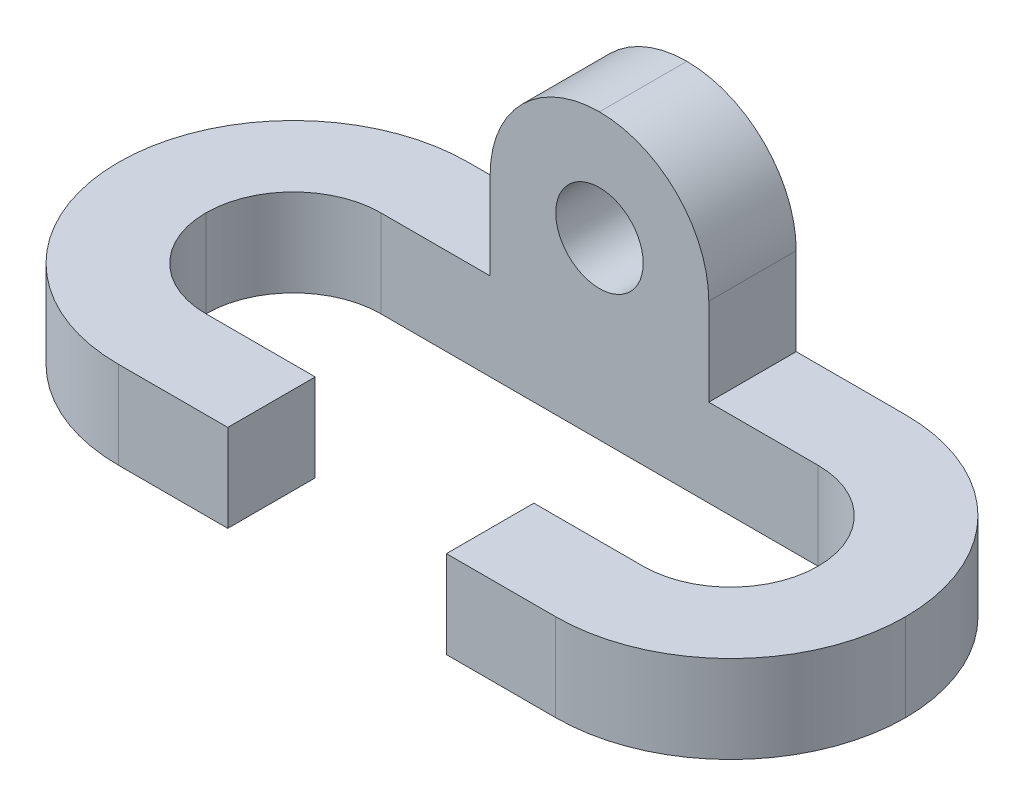
ISO-10303-21;
HEADER;
FILE_DESCRIPTION(('STEP AP214'),'2;1');
FILE_NAME('part.step','',(''),(''),'','','');
FILE_SCHEMA(('AUTOMOTIVE_DESIGN { 1 0 10303 214 1 1 1 1 }'));
ENDSEC;
DATA;
#1=APPLICATION_CONTEXT('core data for automotive mechanical design processes');
#2=APPLICATION_PROTOCOL_DEFINITION('international standard','automotive_design',2000,#1);
#3=PRODUCT_CONTEXT('',#1,'mechanical');
#4=PRODUCT('Part','Part','',(#3));
#5=PRODUCT_RELATED_PRODUCT_CATEGORY('part','',(#4));
#6=PRODUCT_DEFINITION_FORMATION('','',#4);
#7=PRODUCT_DEFINITION_CONTEXT('part definition',#1,'design');
#8=PRODUCT_DEFINITION('design','',#6,#7);
#9=PRODUCT_DEFINITION_SHAPE('','',#8);
#10=(LENGTH_UNIT() NAMED_UNIT(*) SI_UNIT(.MILLI.,.METRE.));
#11=(NAMED_UNIT(*) PLANE_ANGLE_UNIT() SI_UNIT($,.RADIAN.));
#12=(NAMED_UNIT(*) SI_UNIT($,.STERADIAN.) SOLID_ANGLE_UNIT());
#13=UNCERTAINTY_MEASURE_WITH_UNIT(LENGTH_MEASURE(1.E-05),#10,'distance_accuracy_value','');
#14=(GEOMETRIC_REPRESENTATION_CONTEXT(3) GLOBAL_UNCERTAINTY_ASSIGNED_CONTEXT((#13)) GLOBAL_UNIT_ASSIGNED_CONTEXT((#10,
#11,#12)) REPRESENTATION_CONTEXT('',''));
#15=CARTESIAN_POINT('',(0.,0.,0.));
#16=DIRECTION('',(0.,0.,1.));
#17=DIRECTION('',(1.,0.,0.));
#18=AXIS2_PLACEMENT_3D('',#15,#16,#17);
#19=CARTESIAN_POINT('',(0.,0.,0.));
#20=DIRECTION('',(0.,-1.,0.));
#21=DIRECTION('',(0.,0.,-1.));
#22=AXIS2_PLACEMENT_3D('',#19,#20,#21);
#23=PLANE('',#22);
#24=DIRECTION('',(1.,0.,0.));
#25=VECTOR('',#24,1.);
#26=CARTESIAN_POINT('',(0.,0.,0.));
#27=LINE('',#26,#25);
#28=CARTESIAN_POINT('',(25.4,0.,0.));
#29=VERTEX_POINT('',#28);
#30=CARTESIAN_POINT('',(41.275,0.,0.));
#31=VERTEX_POINT('',#30);
#32=EDGE_CURVE('E208',#29,#31,#27,.T.);
#33=ORIENTED_EDGE('',*,*,#32,.T.);
#34=DIRECTION('',(0.,0.,1.));
#35=VECTOR('',#34,1.);
#36=CARTESIAN_POINT('',(41.275,0.,-12.7));
#37=LINE('',#36,#35);
#38=CARTESIAN_POINT('',(41.275,0.,-12.7));
#39=VERTEX_POINT('',#38);
#40=EDGE_CURVE('E177',#39,#31,#37,.T.);
#41=ORIENTED_EDGE('',*,*,#40,.F.);
#42=DIRECTION('',(1.,0.,0.));
#43=VECTOR('',#42,1.);
#44=CARTESIAN_POINT('',(12.7,0.,-12.7));
#45=LINE('',#44,#43);
#46=CARTESIAN_POINT('',(25.4,0.,-12.7));
#47=VERTEX_POINT('',#46);
#48=EDGE_CURVE('E334',#47,#39,#45,.T.);
#49=ORIENTED_EDGE('',*,*,#48,.F.);
#50=CARTESIAN_POINT('',(25.4,0.,-25.4));
#51=DIRECTION('',(0.,-1.,0.));
#52=DIRECTION('',(0.,0.,-1.));
#53=AXIS2_PLACEMENT_3D('',#50,#51,#52);
#54=CIRCLE('',#53,12.7);
#55=CARTESIAN_POINT('',(12.7,0.,-25.4));
#56=VERTEX_POINT('',#55);
#57=EDGE_CURVE('E258',#47,#56,#54,.T.);
#58=ORIENTED_EDGE('',*,*,#57,.T.);
#59=CARTESIAN_POINT('',(25.4,0.,-25.4));
#60=DIRECTION('',(0.,-1.,0.));
#61=DIRECTION('',(0.,0.,-1.));
#62=AXIS2_PLACEMENT_3D('',#59,#60,#61);
#63=CIRCLE('',#62,12.7);
#64=CARTESIAN_POINT('',(25.4,0.,-38.1));
#65=VERTEX_POINT('',#64);
#66=EDGE_CURVE('E271',#56,#65,#63,.T.);
#67=ORIENTED_EDGE('',*,*,#66,.T.);
#68=DIRECTION('',(-1.,0.,0.));
#69=VECTOR('',#68,1.);
#70=CARTESIAN_POINT('',(12.7,0.,-38.1));
#71=LINE('',#70,#69);
#72=CARTESIAN_POINT('',(41.275,0.,-38.1));
#73=VERTEX_POINT('',#72);
#74=EDGE_CURVE('E336',#73,#65,#71,.T.);
#75=ORIENTED_EDGE('',*,*,#74,.F.);
#76=DIRECTION('',(0.,0.,1.));
#77=VECTOR('',#76,1.);
#78=CARTESIAN_POINT('',(41.275,0.,-50.8));
#79=LINE('',#78,#77);
#80=CARTESIAN_POINT('',(41.275,0.,-50.8));
#81=VERTEX_POINT('',#80);
#82=EDGE_CURVE('E307',#81,#73,#79,.T.);
#83=ORIENTED_EDGE('',*,*,#82,.F.);
#84=DIRECTION('',(-1.,0.,0.));
#85=VECTOR('',#84,1.);
#86=CARTESIAN_POINT('',(0.,0.,-50.8));
#87=LINE('',#86,#85);
#88=CARTESIAN_POINT('',(25.4,0.,-50.8));
#89=VERTEX_POINT('',#88);
#90=EDGE_CURVE('E210',#81,#89,#87,.T.);
#91=ORIENTED_EDGE('',*,*,#90,.T.);
#92=CARTESIAN_POINT('',(25.4,0.,-25.4));
#93=DIRECTION('',(0.,-1.,0.));
#94=DIRECTION('',(0.,0.,-1.));
#95=AXIS2_PLACEMENT_3D('',#92,#93,#94);
#96=CIRCLE('',#95,25.4);
#97=CARTESIAN_POINT('',(0.,0.,-25.4));
#98=VERTEX_POINT('',#97);
#99=EDGE_CURVE('E217',#89,#98,#96,.F.);
#100=ORIENTED_EDGE('',*,*,#99,.T.);
#101=CARTESIAN_POINT('',(25.4,0.,-25.4));
#102=DIRECTION('',(0.,-1.,0.));
#103=DIRECTION('',(0.,0.,-1.));
#104=AXIS2_PLACEMENT_3D('',#101,#102,#103);
#105=CIRCLE('',#104,25.4);
#106=EDGE_CURVE('E219',#98,#29,#105,.F.);
#107=ORIENTED_EDGE('',*,*,#106,.T.);
#108=EDGE_LOOP('',(#33,#41,#49,#58,#67,#75,#83,#91,#100,#107));
#109=FACE_BOUND('',#108,.T.);
#110=ADVANCED_FACE('F33',(#109),#23,.F.);
#111=CARTESIAN_POINT('',(0.,-12.7,0.));
#112=DIRECTION('',(0.,0.,1.));
#113=DIRECTION('',(1.,0.,0.));
#114=AXIS2_PLACEMENT_3D('',#111,#112,#113);
#115=PLANE('',#114);
#116=DIRECTION('',(0.,1.,0.));
#117=VECTOR('',#116,1.);
#118=CARTESIAN_POINT('',(41.275,-12.7,0.));
#119=LINE('',#118,#117);
#120=CARTESIAN_POINT('',(41.275,-12.7,0.));
#121=VERTEX_POINT('',#120);
#122=EDGE_CURVE('E174',#121,#31,#119,.T.);
#123=ORIENTED_EDGE('',*,*,#122,.T.);
#124=ORIENTED_EDGE('',*,*,#32,.F.);
#125=DIRECTION('',(0.,1.,0.));
#126=VECTOR('',#125,1.);
#127=CARTESIAN_POINT('',(25.4,-12.7,0.));
#128=LINE('',#127,#126);
#129=CARTESIAN_POINT('',(25.4,-12.7,0.));
#130=VERTEX_POINT('',#129);
#131=EDGE_CURVE('E196',#29,#130,#128,.F.);
#132=ORIENTED_EDGE('',*,*,#131,.T.);
#133=DIRECTION('',(1.,0.,0.));
#134=VECTOR('',#133,1.);
#135=CARTESIAN_POINT('',(0.,-12.7,0.));
#136=LINE('',#135,#134);
#137=EDGE_CURVE('E189',#130,#121,#136,.T.);
#138=ORIENTED_EDGE('',*,*,#137,.T.);
#139=EDGE_LOOP('',(#123,#124,#132,#138));
#140=FACE_BOUND('',#139,.T.);
#141=ADVANCED_FACE('F194',(#140),#115,.T.);
#142=CARTESIAN_POINT('',(12.7,-12.7,-12.7));
#143=DIRECTION('',(0.,0.,1.));
#144=DIRECTION('',(1.,0.,0.));
#145=AXIS2_PLACEMENT_3D('',#142,#143,#144);
#146=PLANE('',#145);
#147=ORIENTED_EDGE('',*,*,#48,.T.);
#148=DIRECTION('',(0.,1.,0.));
#149=VECTOR('',#148,1.);
#150=CARTESIAN_POINT('',(41.275,-12.7,-12.7));
#151=LINE('',#150,#149);
#152=CARTESIAN_POINT('',(41.275,-12.7,-12.7));
#153=VERTEX_POINT('',#152);
#154=EDGE_CURVE('E318',#153,#39,#151,.T.);
#155=ORIENTED_EDGE('',*,*,#154,.F.);
#156=DIRECTION('',(1.,0.,0.));
#157=VECTOR('',#156,1.);
#158=CARTESIAN_POINT('',(12.7,-12.7,-12.7));
#159=LINE('',#158,#157);
#160=CARTESIAN_POINT('',(25.4,-12.7,-12.7));
#161=VERTEX_POINT('',#160);
#162=EDGE_CURVE('E191',#161,#153,#159,.T.);
#163=ORIENTED_EDGE('',*,*,#162,.F.);
#164=DIRECTION('',(0.,1.,0.));
#165=VECTOR('',#164,1.);
#166=CARTESIAN_POINT('',(25.4,0.,-12.7));
#167=LINE('',#166,#165);
#168=EDGE_CURVE('E251',#161,#47,#167,.T.);
#169=ORIENTED_EDGE('',*,*,#168,.T.);
#170=EDGE_LOOP('',(#147,#155,#163,#169));
#171=FACE_BOUND('',#170,.T.);
#172=ADVANCED_FACE('F420',(#171),#146,.F.);
#173=CARTESIAN_POINT('',(73.025,0.,-12.7));
#174=VERTEX_POINT('',#173);
#175=CARTESIAN_POINT('',(88.9,0.,-12.7));
#176=VERTEX_POINT('',#175);
#177=EDGE_CURVE('E244',#174,#176,#45,.T.);
#178=ORIENTED_EDGE('',*,*,#177,.F.);
#179=DIRECTION('',(0.,0.,-1.));
#180=VECTOR('',#179,1.);
#181=CARTESIAN_POINT('',(73.025,0.,-12.7));
#182=LINE('',#181,#180);
#183=CARTESIAN_POINT('',(73.025,0.,0.));
#184=VERTEX_POINT('',#183);
#185=EDGE_CURVE('E49',#184,#174,#182,.T.);
#186=ORIENTED_EDGE('',*,*,#185,.F.);
#187=CARTESIAN_POINT('',(88.9,0.,0.));
#188=VERTEX_POINT('',#187);
#189=EDGE_CURVE('E211',#184,#188,#27,.T.);
#190=ORIENTED_EDGE('',*,*,#189,.T.);
#191=CARTESIAN_POINT('',(88.9,0.,-25.4));
#192=DIRECTION('',(0.,-1.,0.));
#193=DIRECTION('',(0.,0.,-1.));
#194=AXIS2_PLACEMENT_3D('',#191,#192,#193);
#195=CIRCLE('',#194,25.4);
#196=CARTESIAN_POINT('',(114.3,0.,-25.4));
#197=VERTEX_POINT('',#196);
#198=EDGE_CURVE('E201',#188,#197,#195,.F.);
#199=ORIENTED_EDGE('',*,*,#198,.T.);
#200=CARTESIAN_POINT('',(88.9,0.,-25.4));
#201=DIRECTION('',(0.,-1.,0.));
#202=DIRECTION('',(0.,0.,-1.));
#203=AXIS2_PLACEMENT_3D('',#200,#201,#202);
#204=CIRCLE('',#203,25.4);
#205=CARTESIAN_POINT('',(88.9,0.,-50.8));
#206=VERTEX_POINT('',#205);
#207=EDGE_CURVE('E215',#197,#206,#204,.F.);
#208=ORIENTED_EDGE('',*,*,#207,.T.);
#209=CARTESIAN_POINT('',(73.025,0.,-50.8));
#210=VERTEX_POINT('',#209);
#211=EDGE_CURVE('E203',#206,#210,#87,.T.);
#212=ORIENTED_EDGE('',*,*,#211,.T.);
#213=DIRECTION('',(0.,0.,-1.));
#214=VECTOR('',#213,1.);
#215=CARTESIAN_POINT('',(73.025,0.,-50.8));
#216=LINE('',#215,#214);
#217=CARTESIAN_POINT('',(73.025,0.,-38.1));
#218=VERTEX_POINT('',#217);
#219=EDGE_CURVE('E310',#218,#210,#216,.T.);
#220=ORIENTED_EDGE('',*,*,#219,.F.);
#221=CARTESIAN_POINT('',(88.9,0.,-38.1));
#222=VERTEX_POINT('',#221);
#223=EDGE_CURVE('E205',#222,#218,#71,.T.);
#224=ORIENTED_EDGE('',*,*,#223,.F.);
#225=CARTESIAN_POINT('',(88.9,0.,-25.4));
#226=DIRECTION('',(0.,-1.,0.));
#227=DIRECTION('',(0.,0.,-1.));
#228=AXIS2_PLACEMENT_3D('',#225,#226,#227);
#229=CIRCLE('',#228,12.7);
#230=CARTESIAN_POINT('',(101.6,0.,-25.4));
#231=VERTEX_POINT('',#230);
#232=EDGE_CURVE('E267',#222,#231,#229,.T.);
#233=ORIENTED_EDGE('',*,*,#232,.T.);
#234=CARTESIAN_POINT('',(88.9,0.,-25.4));
#235=DIRECTION('',(0.,-1.,0.));
#236=DIRECTION('',(0.,0.,-1.));
#237=AXIS2_PLACEMENT_3D('',#234,#235,#236);
#238=CIRCLE('',#237,12.7);
#239=EDGE_CURVE('E262',#231,#176,#238,.T.);
#240=ORIENTED_EDGE('',*,*,#239,.T.);
#241=EDGE_LOOP('',(#178,#186,#190,#199,#208,#212,#220,#224,#233,#240));
#242=FACE_BOUND('',#241,.T.);
#243=ADVANCED_FACE('F347',(#242),#23,.F.);
#244=CARTESIAN_POINT('',(0.,-12.7,-50.8));
#245=DIRECTION('',(0.,0.,-1.));
#246=DIRECTION('',(-1.,0.,0.));
#247=AXIS2_PLACEMENT_3D('',#244,#245,#246);
#248=PLANE('',#247);
#249=CARTESIAN_POINT('',(57.15,12.7,-50.8));
#250=DIRECTION('',(0.,0.,1.));
#251=DIRECTION('',(1.,0.,0.));
#252=AXIS2_PLACEMENT_3D('',#249,#250,#251);
#253=CIRCLE('',#252,6.35);
#254=CARTESIAN_POINT('',(63.5,12.7,-50.8));
#255=VERTEX_POINT('',#254);
#256=EDGE_CURVE('E308',#255,#255,#253,.T.);
#257=ORIENTED_EDGE('',*,*,#256,.T.);
#258=EDGE_LOOP('',(#257));
#259=FACE_BOUND('',#258,.T.);
#260=DIRECTION('',(0.,-1.,0.));
#261=VECTOR('',#260,1.);
#262=CARTESIAN_POINT('',(41.275,28.575,-50.8));
#263=LINE('',#262,#261);
#264=CARTESIAN_POINT('',(41.275,12.7,-50.8));
#265=VERTEX_POINT('',#264);
#266=EDGE_CURVE('E297',#265,#81,#263,.T.);
#267=ORIENTED_EDGE('',*,*,#266,.F.);
#268=CARTESIAN_POINT('',(57.15,12.7,-50.8));
#269=DIRECTION('',(0.,0.,-1.));
#270=DIRECTION('',(-1.,0.,0.));
#271=AXIS2_PLACEMENT_3D('',#268,#269,#270);
#272=CIRCLE('',#271,15.875);
#273=CARTESIAN_POINT('',(57.15,28.575,-50.8));
#274=VERTEX_POINT('',#273);
#275=EDGE_CURVE('E42',#265,#274,#272,.T.);
#276=ORIENTED_EDGE('',*,*,#275,.T.);
#277=CARTESIAN_POINT('',(57.15,12.7,-50.8));
#278=DIRECTION('',(0.,0.,-1.));
#279=DIRECTION('',(-1.,0.,0.));
#280=AXIS2_PLACEMENT_3D('',#277,#278,#279);
#281=CIRCLE('',#280,15.875);
#282=CARTESIAN_POINT('',(73.025,12.7,-50.8));
#283=VERTEX_POINT('',#282);
#284=EDGE_CURVE('E289',#274,#283,#281,.T.);
#285=ORIENTED_EDGE('',*,*,#284,.T.);
#286=DIRECTION('',(0.,-1.,0.));
#287=VECTOR('',#286,1.);
#288=CARTESIAN_POINT('',(73.025,28.575,-50.8));
#289=LINE('',#288,#287);
#290=EDGE_CURVE('E325',#283,#210,#289,.T.);
#291=ORIENTED_EDGE('',*,*,#290,.T.);
#292=ORIENTED_EDGE('',*,*,#211,.F.);
#293=DIRECTION('',(0.,1.,0.));
#294=VECTOR('',#293,1.);
#295=CARTESIAN_POINT('',(88.9,-12.7,-50.8));
#296=LINE('',#295,#294);
#297=CARTESIAN_POINT('',(88.9,-12.7,-50.8));
#298=VERTEX_POINT('',#297);
#299=EDGE_CURVE('E234',#206,#298,#296,.F.);
#300=ORIENTED_EDGE('',*,*,#299,.T.);
#301=DIRECTION('',(-1.,0.,0.));
#302=VECTOR('',#301,1.);
#303=CARTESIAN_POINT('',(0.,-12.7,-50.8));
#304=LINE('',#303,#302);
#305=CARTESIAN_POINT('',(25.4,-12.7,-50.8));
#306=VERTEX_POINT('',#305);
#307=EDGE_CURVE('E197',#298,#306,#304,.T.);
#308=ORIENTED_EDGE('',*,*,#307,.T.);
#309=DIRECTION('',(0.,1.,0.));
#310=VECTOR('',#309,1.);
#311=CARTESIAN_POINT('',(25.4,-12.7,-50.8));
#312=LINE('',#311,#310);
#313=EDGE_CURVE('E237',#306,#89,#312,.T.);
#314=ORIENTED_EDGE('',*,*,#313,.T.);
#315=ORIENTED_EDGE('',*,*,#90,.F.);
#316=EDGE_LOOP('',(#267,#276,#285,#291,#292,#300,#308,#314,#315));
#317=FACE_BOUND('',#316,.T.);
#318=ADVANCED_FACE('F294',(#259,#317),#248,.T.);
#319=DIRECTION('',(0.,1.,0.));
#320=VECTOR('',#319,1.);
#321=CARTESIAN_POINT('',(73.025,-12.7,0.));
#322=LINE('',#321,#320);
#323=CARTESIAN_POINT('',(73.025,-12.7,0.));
#324=VERTEX_POINT('',#323);
#325=EDGE_CURVE('E182',#324,#184,#322,.T.);
#326=ORIENTED_EDGE('',*,*,#325,.F.);
#327=CARTESIAN_POINT('',(88.9,-12.7,0.));
#328=VERTEX_POINT('',#327);
#329=EDGE_CURVE('E198',#324,#328,#136,.T.);
#330=ORIENTED_EDGE('',*,*,#329,.T.);
#331=DIRECTION('',(0.,1.,0.));
#332=VECTOR('',#331,1.);
#333=CARTESIAN_POINT('',(88.9,-12.7,0.));
#334=LINE('',#333,#332);
#335=EDGE_CURVE('E221',#328,#188,#334,.T.);
#336=ORIENTED_EDGE('',*,*,#335,.T.);
#337=ORIENTED_EDGE('',*,*,#189,.F.);
#338=EDGE_LOOP('',(#326,#330,#336,#337));
#339=FACE_BOUND('',#338,.T.);
#340=ADVANCED_FACE('F398',(#339),#115,.T.);
#341=CARTESIAN_POINT('',(0.,-12.7,0.));
#342=DIRECTION('',(0.,-1.,0.));
#343=DIRECTION('',(0.,0.,-1.));
#344=AXIS2_PLACEMENT_3D('',#341,#342,#343);
#345=PLANE('',#344);
#346=DIRECTION('',(0.,0.,1.));
#347=VECTOR('',#346,1.);
#348=CARTESIAN_POINT('',(41.275,-12.7,-12.7));
#349=LINE('',#348,#347);
#350=EDGE_CURVE('E57',#153,#121,#349,.T.);
#351=ORIENTED_EDGE('',*,*,#350,.T.);
#352=ORIENTED_EDGE('',*,*,#137,.F.);
#353=CARTESIAN_POINT('',(25.4,-12.7,-25.4));
#354=DIRECTION('',(0.,-1.,0.));
#355=DIRECTION('',(0.,0.,-1.));
#356=AXIS2_PLACEMENT_3D('',#353,#354,#355);
#357=CIRCLE('',#356,25.4);
#358=CARTESIAN_POINT('',(0.,-12.7,-25.4));
#359=VERTEX_POINT('',#358);
#360=EDGE_CURVE('E232',#130,#359,#357,.T.);
#361=ORIENTED_EDGE('',*,*,#360,.T.);
#362=CARTESIAN_POINT('',(25.4,-12.7,-25.4));
#363=DIRECTION('',(0.,-1.,0.));
#364=DIRECTION('',(0.,0.,-1.));
#365=AXIS2_PLACEMENT_3D('',#362,#363,#364);
#366=CIRCLE('',#365,25.4);
#367=EDGE_CURVE('E230',#359,#306,#366,.T.);
#368=ORIENTED_EDGE('',*,*,#367,.T.);
#369=ORIENTED_EDGE('',*,*,#307,.F.);
#370=CARTESIAN_POINT('',(88.9,-12.7,-25.4));
#371=DIRECTION('',(0.,-1.,0.));
#372=DIRECTION('',(0.,0.,-1.));
#373=AXIS2_PLACEMENT_3D('',#370,#371,#372);
#374=CIRCLE('',#373,25.4);
#375=CARTESIAN_POINT('',(114.3,-12.7,-25.4));
#376=VERTEX_POINT('',#375);
#377=EDGE_CURVE('E228',#298,#376,#374,.T.);
#378=ORIENTED_EDGE('',*,*,#377,.T.);
#379=CARTESIAN_POINT('',(88.9,-12.7,-25.4));
#380=DIRECTION('',(0.,-1.,0.));
#381=DIRECTION('',(0.,0.,-1.));
#382=AXIS2_PLACEMENT_3D('',#379,#380,#381);
#383=CIRCLE('',#382,25.4);
#384=EDGE_CURVE('E225',#376,#328,#383,.T.);
#385=ORIENTED_EDGE('',*,*,#384,.T.);
#386=ORIENTED_EDGE('',*,*,#329,.F.);
#387=DIRECTION('',(0.,0.,-1.));
#388=VECTOR('',#387,1.);
#389=CARTESIAN_POINT('',(73.025,-12.7,-12.7));
#390=LINE('',#389,#388);
#391=CARTESIAN_POINT('',(73.025,-12.7,-12.7));
#392=VERTEX_POINT('',#391);
#393=EDGE_CURVE('E183',#324,#392,#390,.T.);
#394=ORIENTED_EDGE('',*,*,#393,.T.);
#395=CARTESIAN_POINT('',(88.9,-12.7,-12.7));
#396=VERTEX_POINT('',#395);
#397=EDGE_CURVE('E332',#392,#396,#159,.T.);
#398=ORIENTED_EDGE('',*,*,#397,.T.);
#399=CARTESIAN_POINT('',(88.9,-12.7,-25.4));
#400=DIRECTION('',(0.,-1.,0.));
#401=DIRECTION('',(0.,0.,-1.));
#402=AXIS2_PLACEMENT_3D('',#399,#400,#401);
#403=CIRCLE('',#402,12.7);
#404=CARTESIAN_POINT('',(101.6,-12.7,-25.4));
#405=VERTEX_POINT('',#404);
#406=EDGE_CURVE('E265',#396,#405,#403,.F.);
#407=ORIENTED_EDGE('',*,*,#406,.T.);
#408=CARTESIAN_POINT('',(88.9,-12.7,-25.4));
#409=DIRECTION('',(0.,-1.,0.));
#410=DIRECTION('',(0.,0.,-1.));
#411=AXIS2_PLACEMENT_3D('',#408,#409,#410);
#412=CIRCLE('',#411,12.7);
#413=CARTESIAN_POINT('',(88.9,-12.7,-38.1));
#414=VERTEX_POINT('',#413);
#415=EDGE_CURVE('E269',#405,#414,#412,.F.);
#416=ORIENTED_EDGE('',*,*,#415,.T.);
#417=DIRECTION('',(-1.,0.,0.));
#418=VECTOR('',#417,1.);
#419=CARTESIAN_POINT('',(12.7,-12.7,-38.1));
#420=LINE('',#419,#418);
#421=CARTESIAN_POINT('',(25.4,-12.7,-38.1));
#422=VERTEX_POINT('',#421);
#423=EDGE_CURVE('E331',#414,#422,#420,.T.);
#424=ORIENTED_EDGE('',*,*,#423,.T.);
#425=CARTESIAN_POINT('',(25.4,-12.7,-25.4));
#426=DIRECTION('',(0.,-1.,0.));
#427=DIRECTION('',(0.,0.,-1.));
#428=AXIS2_PLACEMENT_3D('',#425,#426,#427);
#429=CIRCLE('',#428,12.7);
#430=CARTESIAN_POINT('',(12.7,-12.7,-25.4));
#431=VERTEX_POINT('',#430);
#432=EDGE_CURVE('E274',#422,#431,#429,.F.);
#433=ORIENTED_EDGE('',*,*,#432,.T.);
#434=CARTESIAN_POINT('',(25.4,-12.7,-25.4));
#435=DIRECTION('',(0.,-1.,0.));
#436=DIRECTION('',(0.,0.,-1.));
#437=AXIS2_PLACEMENT_3D('',#434,#435,#436);
#438=CIRCLE('',#437,12.7);
#439=EDGE_CURVE('E260',#431,#161,#438,.F.);
#440=ORIENTED_EDGE('',*,*,#439,.T.);
#441=ORIENTED_EDGE('',*,*,#162,.T.);
#442=EDGE_LOOP('',(#351,#352,#361,#368,#369,#378,#385,#386,#394,#398,#407,#416,#424,#433,#440,#441));
#443=FACE_BOUND('',#442,.T.);
#444=ADVANCED_FACE('F188',(#443),#345,.T.);
#445=ORIENTED_EDGE('',*,*,#397,.F.);
#446=DIRECTION('',(0.,1.,0.));
#447=VECTOR('',#446,1.);
#448=CARTESIAN_POINT('',(73.025,-12.7,-12.7));
#449=LINE('',#448,#447);
#450=EDGE_CURVE('E344',#392,#174,#449,.T.);
#451=ORIENTED_EDGE('',*,*,#450,.T.);
#452=ORIENTED_EDGE('',*,*,#177,.T.);
#453=DIRECTION('',(0.,1.,0.));
#454=VECTOR('',#453,1.);
#455=CARTESIAN_POINT('',(88.9,-12.7,-12.7));
#456=LINE('',#455,#454);
#457=EDGE_CURVE('E240',#176,#396,#456,.F.);
#458=ORIENTED_EDGE('',*,*,#457,.T.);
#459=EDGE_LOOP('',(#445,#451,#452,#458));
#460=FACE_BOUND('',#459,.T.);
#461=ADVANCED_FACE('F342',(#460),#146,.F.);
#462=CARTESIAN_POINT('',(12.7,-12.7,-38.1));
#463=DIRECTION('',(0.,0.,-1.));
#464=DIRECTION('',(-1.,0.,0.));
#465=AXIS2_PLACEMENT_3D('',#462,#463,#464);
#466=PLANE('',#465);
#467=CARTESIAN_POINT('',(57.15,12.7,-38.1));
#468=DIRECTION('',(0.,0.,1.));
#469=DIRECTION('',(1.,0.,0.));
#470=AXIS2_PLACEMENT_3D('',#467,#468,#469);
#471=CIRCLE('',#470,6.35);
#472=CARTESIAN_POINT('',(63.5,12.7,-38.1));
#473=VERTEX_POINT('',#472);
#474=EDGE_CURVE('E313',#473,#473,#471,.T.);
#475=ORIENTED_EDGE('',*,*,#474,.F.);
#476=EDGE_LOOP('',(#475));
#477=FACE_BOUND('',#476,.T.);
#478=CARTESIAN_POINT('',(57.15,12.7,-38.1));
#479=DIRECTION('',(0.,0.,-1.));
#480=DIRECTION('',(-1.,0.,0.));
#481=AXIS2_PLACEMENT_3D('',#478,#479,#480);
#482=CIRCLE('',#481,15.875);
#483=CARTESIAN_POINT('',(73.025,12.7,-38.1));
#484=VERTEX_POINT('',#483);
#485=CARTESIAN_POINT('',(57.15,28.575,-38.1));
#486=VERTEX_POINT('',#485);
#487=EDGE_CURVE('E276',#484,#486,#482,.F.);
#488=ORIENTED_EDGE('',*,*,#487,.T.);
#489=CARTESIAN_POINT('',(57.15,12.7,-38.1));
#490=DIRECTION('',(0.,0.,-1.));
#491=DIRECTION('',(-1.,0.,0.));
#492=AXIS2_PLACEMENT_3D('',#489,#490,#491);
#493=CIRCLE('',#492,15.875);
#494=CARTESIAN_POINT('',(41.275,12.7,-38.1));
#495=VERTEX_POINT('',#494);
#496=EDGE_CURVE('E284',#486,#495,#493,.F.);
#497=ORIENTED_EDGE('',*,*,#496,.T.);
#498=DIRECTION('',(0.,-1.,0.));
#499=VECTOR('',#498,1.);
#500=CARTESIAN_POINT('',(41.275,28.575,-38.1));
#501=LINE('',#500,#499);
#502=EDGE_CURVE('E282',#495,#73,#501,.T.);
#503=ORIENTED_EDGE('',*,*,#502,.T.);
#504=ORIENTED_EDGE('',*,*,#74,.T.);
#505=DIRECTION('',(0.,1.,0.));
#506=VECTOR('',#505,1.);
#507=CARTESIAN_POINT('',(25.4,-12.7,-38.1));
#508=LINE('',#507,#506);
#509=EDGE_CURVE('E254',#65,#422,#508,.F.);
#510=ORIENTED_EDGE('',*,*,#509,.T.);
#511=ORIENTED_EDGE('',*,*,#423,.F.);
#512=DIRECTION('',(0.,1.,0.));
#513=VECTOR('',#512,1.);
#514=CARTESIAN_POINT('',(88.9,0.,-38.1));
#515=LINE('',#514,#513);
#516=EDGE_CURVE('E256',#414,#222,#515,.T.);
#517=ORIENTED_EDGE('',*,*,#516,.T.);
#518=ORIENTED_EDGE('',*,*,#223,.T.);
#519=DIRECTION('',(0.,-1.,0.));
#520=VECTOR('',#519,1.);
#521=CARTESIAN_POINT('',(73.025,28.575,-38.1));
#522=LINE('',#521,#520);
#523=EDGE_CURVE('E327',#484,#218,#522,.T.);
#524=ORIENTED_EDGE('',*,*,#523,.F.);
#525=EDGE_LOOP('',(#488,#497,#503,#504,#510,#511,#517,#518,#524));
#526=FACE_BOUND('',#525,.T.);
#527=ADVANCED_FACE('F362',(#477,#526),#466,.F.);
#528=CARTESIAN_POINT('',(25.4,-12.7,-25.4));
#529=DIRECTION('',(0.,1.,0.));
#530=DIRECTION('',(0.,0.,1.));
#531=AXIS2_PLACEMENT_3D('',#528,#529,#530);
#532=CYLINDRICAL_SURFACE('',#531,25.4);
#533=ORIENTED_EDGE('',*,*,#313,.F.);
#534=ORIENTED_EDGE('',*,*,#367,.F.);
#535=DIRECTION('',(0.,1.,0.));
#536=VECTOR('',#535,1.);
#537=CARTESIAN_POINT('',(0.,-12.7,-25.4));
#538=LINE('',#537,#536);
#539=EDGE_CURVE('E241',#98,#359,#538,.F.);
#540=ORIENTED_EDGE('',*,*,#539,.F.);
#541=ORIENTED_EDGE('',*,*,#99,.F.);
#542=EDGE_LOOP('',(#533,#534,#540,#541));
#543=FACE_BOUND('',#542,.T.);
#544=ADVANCED_FACE('F380',(#543),#532,.T.);
#545=CARTESIAN_POINT('',(25.4,-12.7,-25.4));
#546=DIRECTION('',(0.,1.,0.));
#547=DIRECTION('',(0.,0.,1.));
#548=AXIS2_PLACEMENT_3D('',#545,#546,#547);
#549=CYLINDRICAL_SURFACE('',#548,25.4);
#550=ORIENTED_EDGE('',*,*,#360,.F.);
#551=ORIENTED_EDGE('',*,*,#131,.F.);
#552=ORIENTED_EDGE('',*,*,#106,.F.);
#553=ORIENTED_EDGE('',*,*,#539,.T.);
#554=EDGE_LOOP('',(#550,#551,#552,#553));
#555=FACE_BOUND('',#554,.T.);
#556=ADVANCED_FACE('F383',(#555),#549,.T.);
#557=CARTESIAN_POINT('',(88.9,-12.7,-25.4));
#558=DIRECTION('',(0.,1.,0.));
#559=DIRECTION('',(0.,0.,1.));
#560=AXIS2_PLACEMENT_3D('',#557,#558,#559);
#561=CYLINDRICAL_SURFACE('',#560,25.4);
#562=ORIENTED_EDGE('',*,*,#335,.F.);
#563=ORIENTED_EDGE('',*,*,#384,.F.);
#564=DIRECTION('',(0.,1.,0.));
#565=VECTOR('',#564,1.);
#566=CARTESIAN_POINT('',(114.3,-12.7,-25.4));
#567=LINE('',#566,#565);
#568=EDGE_CURVE('E245',#197,#376,#567,.F.);
#569=ORIENTED_EDGE('',*,*,#568,.F.);
#570=ORIENTED_EDGE('',*,*,#198,.F.);
#571=EDGE_LOOP('',(#562,#563,#569,#570));
#572=FACE_BOUND('',#571,.T.);
#573=ADVANCED_FACE('F391',(#572),#561,.T.);
#574=CARTESIAN_POINT('',(88.9,-12.7,-25.4));
#575=DIRECTION('',(0.,1.,0.));
#576=DIRECTION('',(0.,0.,1.));
#577=AXIS2_PLACEMENT_3D('',#574,#575,#576);
#578=CYLINDRICAL_SURFACE('',#577,25.4);
#579=ORIENTED_EDGE('',*,*,#377,.F.);
#580=ORIENTED_EDGE('',*,*,#299,.F.);
#581=ORIENTED_EDGE('',*,*,#207,.F.);
#582=ORIENTED_EDGE('',*,*,#568,.T.);
#583=EDGE_LOOP('',(#579,#580,#581,#582));
#584=FACE_BOUND('',#583,.T.);
#585=ADVANCED_FACE('F394',(#584),#578,.T.);
#586=CARTESIAN_POINT('',(25.4,-12.7,-25.4));
#587=DIRECTION('',(0.,-1.,0.));
#588=DIRECTION('',(0.,0.,-1.));
#589=AXIS2_PLACEMENT_3D('',#586,#587,#588);
#590=CYLINDRICAL_SURFACE('',#589,12.7);
#591=DIRECTION('',(0.,1.,0.));
#592=VECTOR('',#591,1.);
#593=CARTESIAN_POINT('',(12.7,0.,-25.4));
#594=LINE('',#593,#592);
#595=EDGE_CURVE('E248',#431,#56,#594,.T.);
#596=ORIENTED_EDGE('',*,*,#595,.F.);
#597=ORIENTED_EDGE('',*,*,#432,.F.);
#598=ORIENTED_EDGE('',*,*,#509,.F.);
#599=ORIENTED_EDGE('',*,*,#66,.F.);
#600=EDGE_LOOP('',(#596,#597,#598,#599));
#601=FACE_BOUND('',#600,.T.);
#602=ADVANCED_FACE('F451',(#601),#590,.F.);
#603=CARTESIAN_POINT('',(25.4,-12.7,-25.4));
#604=DIRECTION('',(0.,-1.,0.));
#605=DIRECTION('',(0.,0.,-1.));
#606=AXIS2_PLACEMENT_3D('',#603,#604,#605);
#607=CYLINDRICAL_SURFACE('',#606,12.7);
#608=ORIENTED_EDGE('',*,*,#439,.F.);
#609=ORIENTED_EDGE('',*,*,#595,.T.);
#610=ORIENTED_EDGE('',*,*,#57,.F.);
#611=ORIENTED_EDGE('',*,*,#168,.F.);
#612=EDGE_LOOP('',(#608,#609,#610,#611));
#613=FACE_BOUND('',#612,.T.);
#614=ADVANCED_FACE('F454',(#613),#607,.F.);
#615=CARTESIAN_POINT('',(88.9,-12.7,-25.4));
#616=DIRECTION('',(0.,-1.,0.));
#617=DIRECTION('',(0.,0.,-1.));
#618=AXIS2_PLACEMENT_3D('',#615,#616,#617);
#619=CYLINDRICAL_SURFACE('',#618,12.7);
#620=ORIENTED_EDGE('',*,*,#516,.F.);
#621=ORIENTED_EDGE('',*,*,#415,.F.);
#622=DIRECTION('',(0.,1.,0.));
#623=VECTOR('',#622,1.);
#624=CARTESIAN_POINT('',(101.6,-12.7,-25.4));
#625=LINE('',#624,#623);
#626=EDGE_CURVE('E279',#231,#405,#625,.F.);
#627=ORIENTED_EDGE('',*,*,#626,.F.);
#628=ORIENTED_EDGE('',*,*,#232,.F.);
#629=EDGE_LOOP('',(#620,#621,#627,#628));
#630=FACE_BOUND('',#629,.T.);
#631=ADVANCED_FACE('F359',(#630),#619,.F.);
#632=CARTESIAN_POINT('',(88.9,-12.7,-25.4));
#633=DIRECTION('',(0.,-1.,0.));
#634=DIRECTION('',(0.,0.,-1.));
#635=AXIS2_PLACEMENT_3D('',#632,#633,#634);
#636=CYLINDRICAL_SURFACE('',#635,12.7);
#637=ORIENTED_EDGE('',*,*,#406,.F.);
#638=ORIENTED_EDGE('',*,*,#457,.F.);
#639=ORIENTED_EDGE('',*,*,#239,.F.);
#640=ORIENTED_EDGE('',*,*,#626,.T.);
#641=EDGE_LOOP('',(#637,#638,#639,#640));
#642=FACE_BOUND('',#641,.T.);
#643=ADVANCED_FACE('F353',(#642),#636,.F.);
#644=CARTESIAN_POINT('',(41.275,28.575,-50.8));
#645=DIRECTION('',(1.,0.,0.));
#646=DIRECTION('',(0.,0.,-1.));
#647=AXIS2_PLACEMENT_3D('',#644,#645,#646);
#648=PLANE('',#647);
#649=ORIENTED_EDGE('',*,*,#502,.F.);
#650=DIRECTION('',(0.,0.,1.));
#651=VECTOR('',#650,1.);
#652=CARTESIAN_POINT('',(41.275,12.7,-50.8));
#653=LINE('',#652,#651);
#654=EDGE_CURVE('E286',#495,#265,#653,.F.);
#655=ORIENTED_EDGE('',*,*,#654,.T.);
#656=ORIENTED_EDGE('',*,*,#266,.T.);
#657=ORIENTED_EDGE('',*,*,#82,.T.);
#658=EDGE_LOOP('',(#649,#655,#656,#657));
#659=FACE_BOUND('',#658,.T.);
#660=ADVANCED_FACE('F371',(#659),#648,.F.);
#661=CARTESIAN_POINT('',(73.025,28.575,-50.8));
#662=DIRECTION('',(-1.,0.,0.));
#663=DIRECTION('',(0.,0.,1.));
#664=AXIS2_PLACEMENT_3D('',#661,#662,#663);
#665=PLANE('',#664);
#666=ORIENTED_EDGE('',*,*,#290,.F.);
#667=DIRECTION('',(0.,0.,-1.));
#668=VECTOR('',#667,1.);
#669=CARTESIAN_POINT('',(73.025,12.7,-38.1));
#670=LINE('',#669,#668);
#671=EDGE_CURVE('E11',#283,#484,#670,.F.);
#672=ORIENTED_EDGE('',*,*,#671,.T.);
#673=ORIENTED_EDGE('',*,*,#523,.T.);
#674=ORIENTED_EDGE('',*,*,#219,.T.);
#675=EDGE_LOOP('',(#666,#672,#673,#674));
#676=FACE_BOUND('',#675,.T.);
#677=ADVANCED_FACE('F367',(#676),#665,.F.);
#678=CARTESIAN_POINT('',(57.15,12.7,0.));
#679=DIRECTION('',(0.,0.,1.));
#680=DIRECTION('',(1.,0.,0.));
#681=AXIS2_PLACEMENT_3D('',#678,#679,#680);
#682=CYLINDRICAL_SURFACE('',#681,15.875);
#683=ORIENTED_EDGE('',*,*,#671,.F.);
#684=ORIENTED_EDGE('',*,*,#284,.F.);
#685=DIRECTION('',(0.,0.,-1.));
#686=VECTOR('',#685,1.);
#687=CARTESIAN_POINT('',(57.15,28.575,-50.8));
#688=LINE('',#687,#686);
#689=EDGE_CURVE('E37',#486,#274,#688,.T.);
#690=ORIENTED_EDGE('',*,*,#689,.F.);
#691=ORIENTED_EDGE('',*,*,#487,.F.);
#692=EDGE_LOOP('',(#683,#684,#690,#691));
#693=FACE_BOUND('',#692,.T.);
#694=ADVANCED_FACE('F35',(#693),#682,.T.);
#695=CARTESIAN_POINT('',(57.15,12.7,0.));
#696=DIRECTION('',(0.,0.,-1.));
#697=DIRECTION('',(-1.,0.,0.));
#698=AXIS2_PLACEMENT_3D('',#695,#696,#697);
#699=CYLINDRICAL_SURFACE('',#698,15.875);
#700=ORIENTED_EDGE('',*,*,#275,.F.);
#701=ORIENTED_EDGE('',*,*,#654,.F.);
#702=ORIENTED_EDGE('',*,*,#496,.F.);
#703=ORIENTED_EDGE('',*,*,#689,.T.);
#704=EDGE_LOOP('',(#700,#701,#702,#703));
#705=FACE_BOUND('',#704,.T.);
#706=ADVANCED_FACE('F306',(#705),#699,.T.);
#707=CARTESIAN_POINT('',(57.15,12.7,-50.8));
#708=DIRECTION('',(0.,0.,1.));
#709=DIRECTION('',(1.,0.,0.));
#710=AXIS2_PLACEMENT_3D('',#707,#708,#709);
#711=CYLINDRICAL_SURFACE('',#710,6.35);
#712=ORIENTED_EDGE('',*,*,#256,.F.);
#713=EDGE_LOOP('',(#712));
#714=FACE_BOUND('',#713,.T.);
#715=ORIENTED_EDGE('',*,*,#474,.T.);
#716=EDGE_LOOP('',(#715));
#717=FACE_BOUND('',#716,.T.);
#718=ADVANCED_FACE('F406',(#714,#717),#711,.F.);
#719=CARTESIAN_POINT('',(73.025,-12.7,-12.7));
#720=DIRECTION('',(1.,0.,0.));
#721=DIRECTION('',(0.,0.,-1.));
#722=AXIS2_PLACEMENT_3D('',#719,#720,#721);
#723=PLANE('',#722);
#724=ORIENTED_EDGE('',*,*,#185,.T.);
#725=ORIENTED_EDGE('',*,*,#450,.F.);
#726=ORIENTED_EDGE('',*,*,#393,.F.);
#727=ORIENTED_EDGE('',*,*,#325,.T.);
#728=EDGE_LOOP('',(#724,#725,#726,#727));
#729=FACE_BOUND('',#728,.T.);
#730=ADVANCED_FACE('F404',(#729),#723,.F.);
#731=CARTESIAN_POINT('',(41.275,-12.7,-12.7));
#732=DIRECTION('',(-1.,0.,0.));
#733=DIRECTION('',(0.,0.,1.));
#734=AXIS2_PLACEMENT_3D('',#731,#732,#733);
#735=PLANE('',#734);
#736=ORIENTED_EDGE('',*,*,#40,.T.);
#737=ORIENTED_EDGE('',*,*,#122,.F.);
#738=ORIENTED_EDGE('',*,*,#350,.F.);
#739=ORIENTED_EDGE('',*,*,#154,.T.);
#740=EDGE_LOOP('',(#736,#737,#738,#739));
#741=FACE_BOUND('',#740,.T.);
#742=ADVANCED_FACE('F175',(#741),#735,.F.);
#743=CLOSED_SHELL('',(#110,#141,#172,#243,#318,#340,#444,#461,#527,#544,#556,#573,#585,#602,
#614,#631,#643,#660,#677,#694,#706,#718,#730,#742));
#744=MANIFOLD_SOLID_BREP('B2',#743);
#745=ADVANCED_BREP_SHAPE_REPRESENTATION('',(#18,#744),#14);
#746=SHAPE_DEFINITION_REPRESENTATION(#9,#745);
ENDSEC;
END-ISO-10303-21;
